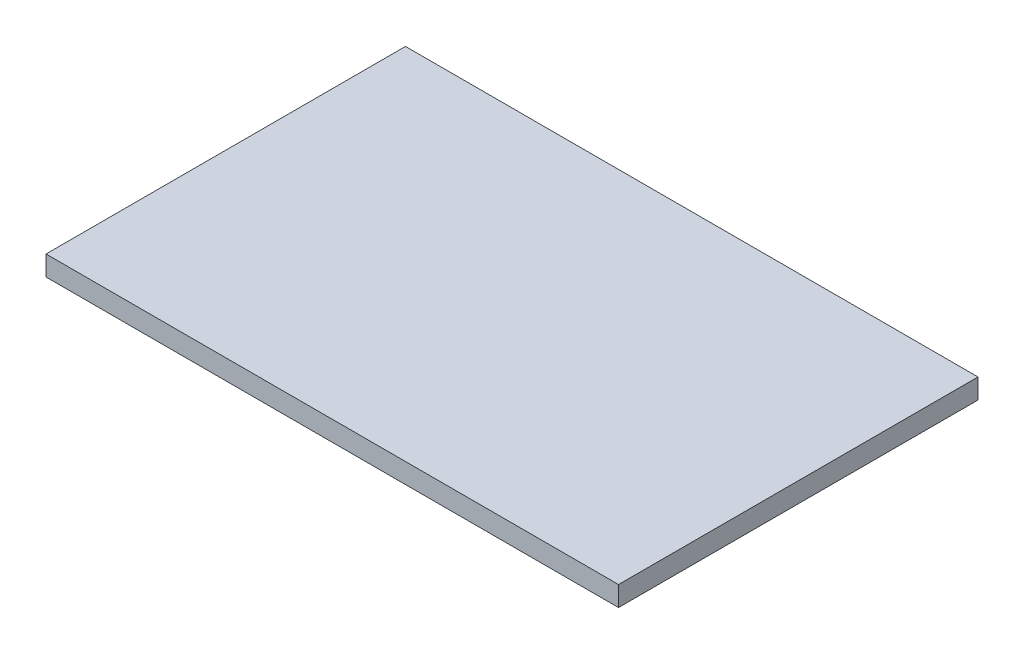
ISO-10303-21;
HEADER;
FILE_DESCRIPTION(('STEP AP214'),'2;1');
FILE_NAME('part.step','',(''),(''),'','','');
FILE_SCHEMA(('AUTOMOTIVE_DESIGN { 1 0 10303 214 1 1 1 1 }'));
ENDSEC;
DATA;
#1=APPLICATION_CONTEXT('core data for automotive mechanical design processes');
#2=APPLICATION_PROTOCOL_DEFINITION('international standard','automotive_design',2000,#1);
#3=PRODUCT_CONTEXT('',#1,'mechanical');
#4=PRODUCT('Part','Part','',(#3));
#5=PRODUCT_RELATED_PRODUCT_CATEGORY('part','',(#4));
#6=PRODUCT_DEFINITION_FORMATION('','',#4);
#7=PRODUCT_DEFINITION_CONTEXT('part definition',#1,'design');
#8=PRODUCT_DEFINITION('design','',#6,#7);
#9=PRODUCT_DEFINITION_SHAPE('','',#8);
#10=(LENGTH_UNIT() NAMED_UNIT(*) SI_UNIT(.MILLI.,.METRE.));
#11=(NAMED_UNIT(*) PLANE_ANGLE_UNIT() SI_UNIT($,.RADIAN.));
#12=(NAMED_UNIT(*) SI_UNIT($,.STERADIAN.) SOLID_ANGLE_UNIT());
#13=UNCERTAINTY_MEASURE_WITH_UNIT(LENGTH_MEASURE(1.E-05),#10,'distance_accuracy_value','');
#14=(GEOMETRIC_REPRESENTATION_CONTEXT(3) GLOBAL_UNCERTAINTY_ASSIGNED_CONTEXT((#13)) GLOBAL_UNIT_ASSIGNED_CONTEXT((#10,
#11,#12)) REPRESENTATION_CONTEXT('',''));
#15=CARTESIAN_POINT('',(0.,0.,0.));
#16=DIRECTION('',(0.,0.,1.));
#17=DIRECTION('',(1.,0.,0.));
#18=AXIS2_PLACEMENT_3D('',#15,#16,#17);
#19=CARTESIAN_POINT('',(0.,0.,2700.));
#20=DIRECTION('',(1.,0.,0.));
#21=DIRECTION('',(0.,0.,-1.));
#22=AXIS2_PLACEMENT_3D('',#19,#20,#21);
#23=PLANE('',#22);
#24=DIRECTION('',(0.,-1.,0.));
#25=VECTOR('',#24,1.);
#26=CARTESIAN_POINT('',(0.,0.,0.));
#27=LINE('',#26,#25);
#28=CARTESIAN_POINT('',(0.,150.,0.));
#29=VERTEX_POINT('',#28);
#30=CARTESIAN_POINT('',(0.,0.,0.));
#31=VERTEX_POINT('',#30);
#32=EDGE_CURVE('E107',#29,#31,#27,.T.);
#33=ORIENTED_EDGE('',*,*,#32,.T.);
#34=DIRECTION('',(0.,0.,-1.));
#35=VECTOR('',#34,1.);
#36=CARTESIAN_POINT('',(0.,0.,2700.));
#37=LINE('',#36,#35);
#38=CARTESIAN_POINT('',(0.,0.,2700.));
#39=VERTEX_POINT('',#38);
#40=EDGE_CURVE('E11',#39,#31,#37,.T.);
#41=ORIENTED_EDGE('',*,*,#40,.F.);
#42=DIRECTION('',(0.,-1.,0.));
#43=VECTOR('',#42,1.);
#44=CARTESIAN_POINT('',(0.,0.,2700.));
#45=LINE('',#44,#43);
#46=CARTESIAN_POINT('',(0.,150.,2700.));
#47=VERTEX_POINT('',#46);
#48=EDGE_CURVE('E91',#47,#39,#45,.T.);
#49=ORIENTED_EDGE('',*,*,#48,.F.);
#50=DIRECTION('',(0.,0.,-1.));
#51=VECTOR('',#50,1.);
#52=CARTESIAN_POINT('',(0.,150.,2700.));
#53=LINE('',#52,#51);
#54=EDGE_CURVE('E103',#47,#29,#53,.T.);
#55=ORIENTED_EDGE('',*,*,#54,.T.);
#56=EDGE_LOOP('',(#33,#41,#49,#55));
#57=FACE_BOUND('',#56,.T.);
#58=ADVANCED_FACE('F39',(#57),#23,.F.);
#59=CARTESIAN_POINT('',(0.,0.,2700.));
#60=DIRECTION('',(0.,1.,0.));
#61=DIRECTION('',(0.,0.,1.));
#62=AXIS2_PLACEMENT_3D('',#59,#60,#61);
#63=PLANE('',#62);
#64=DIRECTION('',(1.,0.,0.));
#65=VECTOR('',#64,1.);
#66=CARTESIAN_POINT('',(0.,0.,0.));
#67=LINE('',#66,#65);
#68=CARTESIAN_POINT('',(4300.,0.,0.));
#69=VERTEX_POINT('',#68);
#70=EDGE_CURVE('E96',#31,#69,#67,.T.);
#71=ORIENTED_EDGE('',*,*,#70,.T.);
#72=DIRECTION('',(0.,0.,-1.));
#73=VECTOR('',#72,1.);
#74=CARTESIAN_POINT('',(4300.,0.,2700.));
#75=LINE('',#74,#73);
#76=CARTESIAN_POINT('',(4300.,0.,2700.));
#77=VERTEX_POINT('',#76);
#78=EDGE_CURVE('E48',#77,#69,#75,.T.);
#79=ORIENTED_EDGE('',*,*,#78,.F.);
#80=DIRECTION('',(1.,0.,0.));
#81=VECTOR('',#80,1.);
#82=CARTESIAN_POINT('',(0.,0.,2700.));
#83=LINE('',#82,#81);
#84=EDGE_CURVE('E86',#39,#77,#83,.T.);
#85=ORIENTED_EDGE('',*,*,#84,.F.);
#86=ORIENTED_EDGE('',*,*,#40,.T.);
#87=EDGE_LOOP('',(#71,#79,#85,#86));
#88=FACE_BOUND('',#87,.T.);
#89=ADVANCED_FACE('F95',(#88),#63,.F.);
#90=CARTESIAN_POINT('',(4300.,0.,2700.));
#91=DIRECTION('',(-1.,0.,0.));
#92=DIRECTION('',(0.,0.,1.));
#93=AXIS2_PLACEMENT_3D('',#90,#91,#92);
#94=PLANE('',#93);
#95=DIRECTION('',(0.,1.,0.));
#96=VECTOR('',#95,1.);
#97=CARTESIAN_POINT('',(4300.,0.,0.));
#98=LINE('',#97,#96);
#99=CARTESIAN_POINT('',(4300.,150.,0.));
#100=VERTEX_POINT('',#99);
#101=EDGE_CURVE('E73',#69,#100,#98,.T.);
#102=ORIENTED_EDGE('',*,*,#101,.T.);
#103=DIRECTION('',(0.,0.,-1.));
#104=VECTOR('',#103,1.);
#105=CARTESIAN_POINT('',(4300.,150.,2700.));
#106=LINE('',#105,#104);
#107=CARTESIAN_POINT('',(4300.,150.,2700.));
#108=VERTEX_POINT('',#107);
#109=EDGE_CURVE('E98',#108,#100,#106,.T.);
#110=ORIENTED_EDGE('',*,*,#109,.F.);
#111=DIRECTION('',(0.,1.,0.));
#112=VECTOR('',#111,1.);
#113=CARTESIAN_POINT('',(4300.,0.,2700.));
#114=LINE('',#113,#112);
#115=EDGE_CURVE('E89',#77,#108,#114,.T.);
#116=ORIENTED_EDGE('',*,*,#115,.F.);
#117=ORIENTED_EDGE('',*,*,#78,.T.);
#118=EDGE_LOOP('',(#102,#110,#116,#117));
#119=FACE_BOUND('',#118,.T.);
#120=ADVANCED_FACE('F99',(#119),#94,.F.);
#121=CARTESIAN_POINT('',(0.,150.,2700.));
#122=DIRECTION('',(0.,-1.,0.));
#123=DIRECTION('',(1.,0.,0.));
#124=AXIS2_PLACEMENT_3D('',#121,#122,#123);
#125=PLANE('',#124);
#126=DIRECTION('',(-1.,0.,0.));
#127=VECTOR('',#126,1.);
#128=CARTESIAN_POINT('',(0.,150.,0.));
#129=LINE('',#128,#127);
#130=EDGE_CURVE('E79',#100,#29,#129,.T.);
#131=ORIENTED_EDGE('',*,*,#130,.T.);
#132=ORIENTED_EDGE('',*,*,#54,.F.);
#133=DIRECTION('',(-1.,0.,0.));
#134=VECTOR('',#133,1.);
#135=CARTESIAN_POINT('',(0.,150.,2700.));
#136=LINE('',#135,#134);
#137=EDGE_CURVE('E56',#108,#47,#136,.T.);
#138=ORIENTED_EDGE('',*,*,#137,.F.);
#139=ORIENTED_EDGE('',*,*,#109,.T.);
#140=EDGE_LOOP('',(#131,#132,#138,#139));
#141=FACE_BOUND('',#140,.T.);
#142=ADVANCED_FACE('F120',(#141),#125,.F.);
#143=CARTESIAN_POINT('',(0.,0.,2700.));
#144=DIRECTION('',(0.,0.,-1.));
#145=DIRECTION('',(-1.,0.,0.));
#146=AXIS2_PLACEMENT_3D('',#143,#144,#145);
#147=PLANE('',#146);
#148=ORIENTED_EDGE('',*,*,#48,.T.);
#149=ORIENTED_EDGE('',*,*,#84,.T.);
#150=ORIENTED_EDGE('',*,*,#115,.T.);
#151=ORIENTED_EDGE('',*,*,#137,.T.);
#152=EDGE_LOOP('',(#148,#149,#150,#151));
#153=FACE_BOUND('',#152,.T.);
#154=ADVANCED_FACE('F87',(#153),#147,.F.);
#155=CARTESIAN_POINT('',(0.,0.,0.));
#156=DIRECTION('',(0.,0.,-1.));
#157=DIRECTION('',(-1.,0.,0.));
#158=AXIS2_PLACEMENT_3D('',#155,#156,#157);
#159=PLANE('',#158);
#160=ORIENTED_EDGE('',*,*,#32,.F.);
#161=ORIENTED_EDGE('',*,*,#130,.F.);
#162=ORIENTED_EDGE('',*,*,#101,.F.);
#163=ORIENTED_EDGE('',*,*,#70,.F.);
#164=EDGE_LOOP('',(#160,#161,#162,#163));
#165=FACE_BOUND('',#164,.T.);
#166=ADVANCED_FACE('F123',(#165),#159,.T.);
#167=CLOSED_SHELL('',(#58,#89,#120,#142,#154,#166));
#168=MANIFOLD_SOLID_BREP('B2',#167);
#169=ADVANCED_BREP_SHAPE_REPRESENTATION('',(#18,#168),#14);
#170=SHAPE_DEFINITION_REPRESENTATION(#9,#169);
ENDSEC;
END-ISO-10303-21;
